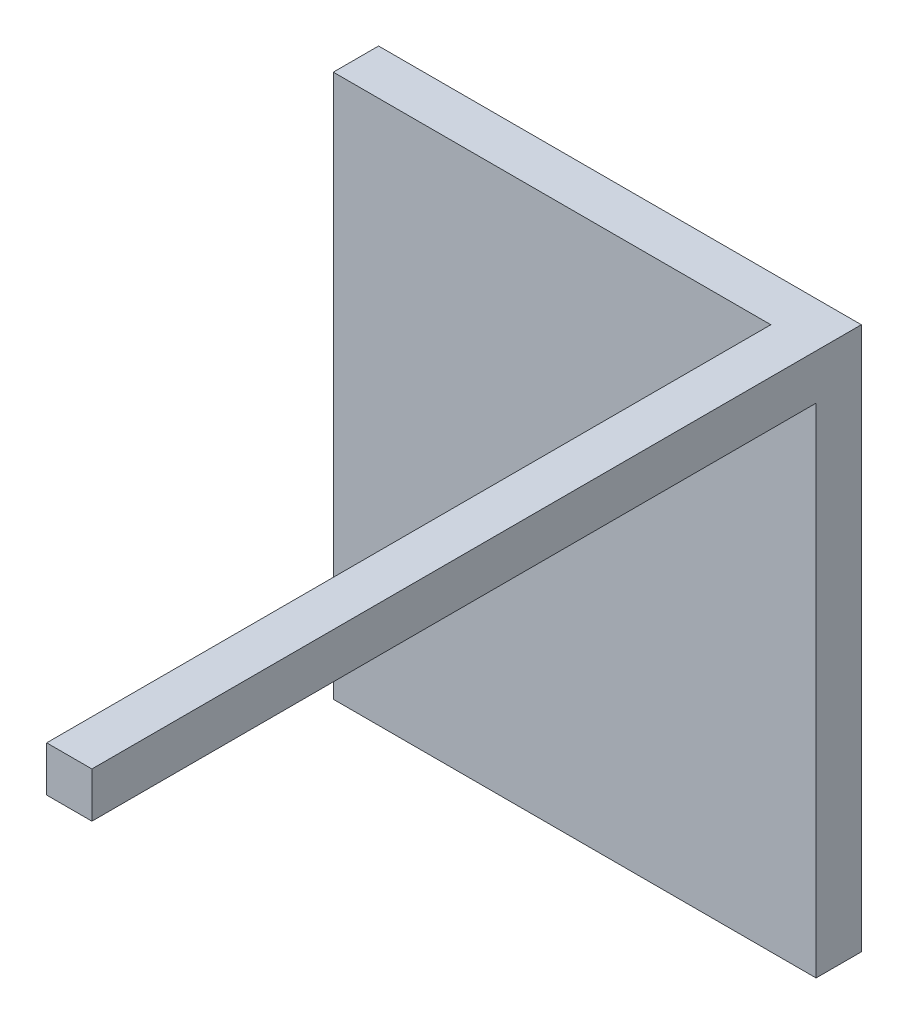
ISO-10303-21;
HEADER;
FILE_DESCRIPTION(('STEP AP214'),'2;1');
FILE_NAME('part.step','',(''),(''),'','','');
FILE_SCHEMA(('AUTOMOTIVE_DESIGN { 1 0 10303 214 1 1 1 1 }'));
ENDSEC;
DATA;
#1=APPLICATION_CONTEXT('core data for automotive mechanical design processes');
#2=APPLICATION_PROTOCOL_DEFINITION('international standard','automotive_design',2000,#1);
#3=PRODUCT_CONTEXT('',#1,'mechanical');
#4=PRODUCT('Part','Part','',(#3));
#5=PRODUCT_RELATED_PRODUCT_CATEGORY('part','',(#4));
#6=PRODUCT_DEFINITION_FORMATION('','',#4);
#7=PRODUCT_DEFINITION_CONTEXT('part definition',#1,'design');
#8=PRODUCT_DEFINITION('design','',#6,#7);
#9=PRODUCT_DEFINITION_SHAPE('','',#8);
#10=(LENGTH_UNIT() NAMED_UNIT(*) SI_UNIT(.MILLI.,.METRE.));
#11=(NAMED_UNIT(*) PLANE_ANGLE_UNIT() SI_UNIT($,.RADIAN.));
#12=(NAMED_UNIT(*) SI_UNIT($,.STERADIAN.) SOLID_ANGLE_UNIT());
#13=UNCERTAINTY_MEASURE_WITH_UNIT(LENGTH_MEASURE(1.E-05),#10,'distance_accuracy_value','');
#14=(GEOMETRIC_REPRESENTATION_CONTEXT(3) GLOBAL_UNCERTAINTY_ASSIGNED_CONTEXT((#13)) GLOBAL_UNIT_ASSIGNED_CONTEXT((#10,
#11,#12)) REPRESENTATION_CONTEXT('',''));
#15=CARTESIAN_POINT('',(0.,0.,0.));
#16=DIRECTION('',(0.,0.,1.));
#17=DIRECTION('',(1.,0.,0.));
#18=AXIS2_PLACEMENT_3D('',#15,#16,#17);
#19=CARTESIAN_POINT('',(0.,228.6,38.1));
#20=DIRECTION('',(-1.,0.,0.));
#21=DIRECTION('',(0.,0.,1.));
#22=AXIS2_PLACEMENT_3D('',#19,#20,#21);
#23=PLANE('',#22);
#24=DIRECTION('',(0.,1.,0.));
#25=VECTOR('',#24,1.);
#26=CARTESIAN_POINT('',(0.,228.6,0.));
#27=LINE('',#26,#25);
#28=CARTESIAN_POINT('',(0.,0.,0.));
#29=VERTEX_POINT('',#28);
#30=CARTESIAN_POINT('',(0.,457.2,0.));
#31=VERTEX_POINT('',#30);
#32=EDGE_CURVE('E118',#29,#31,#27,.T.);
#33=ORIENTED_EDGE('',*,*,#32,.F.);
#34=DIRECTION('',(0.,0.,-1.));
#35=VECTOR('',#34,1.);
#36=CARTESIAN_POINT('',(0.,0.,38.1));
#37=LINE('',#36,#35);
#38=CARTESIAN_POINT('',(0.,0.,38.1));
#39=VERTEX_POINT('',#38);
#40=EDGE_CURVE('E10',#39,#29,#37,.T.);
#41=ORIENTED_EDGE('',*,*,#40,.F.);
#42=DIRECTION('',(0.,1.,0.));
#43=VECTOR('',#42,1.);
#44=CARTESIAN_POINT('',(0.,228.6,38.1));
#45=LINE('',#44,#43);
#46=CARTESIAN_POINT('',(0.,457.2,38.1));
#47=VERTEX_POINT('',#46);
#48=EDGE_CURVE('E131',#39,#47,#45,.T.);
#49=ORIENTED_EDGE('',*,*,#48,.T.);
#50=DIRECTION('',(0.,0.,-1.));
#51=VECTOR('',#50,1.);
#52=CARTESIAN_POINT('',(0.,457.2,38.1));
#53=LINE('',#52,#51);
#54=EDGE_CURVE('E144',#47,#31,#53,.T.);
#55=ORIENTED_EDGE('',*,*,#54,.T.);
#56=EDGE_LOOP('',(#33,#41,#49,#55));
#57=FACE_BOUND('',#56,.T.);
#58=ADVANCED_FACE('F16',(#57),#23,.T.);
#59=CARTESIAN_POINT('',(213.359993903296,0.,38.1));
#60=DIRECTION('',(0.,1.,0.));
#61=DIRECTION('',(0.,0.,1.));
#62=AXIS2_PLACEMENT_3D('',#59,#60,#61);
#63=PLANE('',#62);
#64=DIRECTION('',(1.,0.,0.));
#65=VECTOR('',#64,1.);
#66=CARTESIAN_POINT('',(213.359993903296,0.,0.));
#67=LINE('',#66,#65);
#68=CARTESIAN_POINT('',(406.4,0.,0.));
#69=VERTEX_POINT('',#68);
#70=EDGE_CURVE('E125',#29,#69,#67,.T.);
#71=ORIENTED_EDGE('',*,*,#70,.T.);
#72=DIRECTION('',(0.,0.,-1.));
#73=VECTOR('',#72,1.);
#74=CARTESIAN_POINT('',(406.4,0.,38.1));
#75=LINE('',#74,#73);
#76=CARTESIAN_POINT('',(406.4,0.,38.1));
#77=VERTEX_POINT('',#76);
#78=EDGE_CURVE('E24',#77,#69,#75,.T.);
#79=ORIENTED_EDGE('',*,*,#78,.F.);
#80=DIRECTION('',(1.,0.,0.));
#81=VECTOR('',#80,1.);
#82=CARTESIAN_POINT('',(213.359993903296,0.,38.1));
#83=LINE('',#82,#81);
#84=EDGE_CURVE('E135',#39,#77,#83,.T.);
#85=ORIENTED_EDGE('',*,*,#84,.F.);
#86=ORIENTED_EDGE('',*,*,#40,.T.);
#87=EDGE_LOOP('',(#71,#79,#85,#86));
#88=FACE_BOUND('',#87,.T.);
#89=ADVANCED_FACE('F189',(#88),#63,.F.);
#90=CARTESIAN_POINT('',(406.4,228.6,38.1));
#91=DIRECTION('',(-1.,0.,0.));
#92=DIRECTION('',(0.,-1.,0.));
#93=AXIS2_PLACEMENT_3D('',#90,#91,#92);
#94=PLANE('',#93);
#95=DIRECTION('',(0.,1.,0.));
#96=VECTOR('',#95,1.);
#97=CARTESIAN_POINT('',(406.4,228.6,0.));
#98=LINE('',#97,#96);
#99=CARTESIAN_POINT('',(406.4,457.2,0.));
#100=VERTEX_POINT('',#99);
#101=EDGE_CURVE('E148',#69,#100,#98,.T.);
#102=ORIENTED_EDGE('',*,*,#101,.T.);
#103=DIRECTION('',(0.,0.,-1.));
#104=VECTOR('',#103,1.);
#105=CARTESIAN_POINT('',(406.4,457.2,38.1));
#106=LINE('',#105,#104);
#107=CARTESIAN_POINT('',(406.4,457.2,647.7));
#108=VERTEX_POINT('',#107);
#109=EDGE_CURVE('E157',#108,#100,#106,.T.);
#110=ORIENTED_EDGE('',*,*,#109,.F.);
#111=DIRECTION('',(0.,1.,0.));
#112=VECTOR('',#111,1.);
#113=CARTESIAN_POINT('',(406.4,228.6,647.7));
#114=LINE('',#113,#112);
#115=CARTESIAN_POINT('',(406.4,419.1,647.7));
#116=VERTEX_POINT('',#115);
#117=EDGE_CURVE('E104',#116,#108,#114,.T.);
#118=ORIENTED_EDGE('',*,*,#117,.F.);
#119=DIRECTION('',(0.,0.,-1.));
#120=VECTOR('',#119,1.);
#121=CARTESIAN_POINT('',(406.4,419.1,647.7));
#122=LINE('',#121,#120);
#123=CARTESIAN_POINT('',(406.4,419.1,38.1));
#124=VERTEX_POINT('',#123);
#125=EDGE_CURVE('E99',#116,#124,#122,.T.);
#126=ORIENTED_EDGE('',*,*,#125,.T.);
#127=DIRECTION('',(0.,1.,0.));
#128=VECTOR('',#127,1.);
#129=CARTESIAN_POINT('',(406.4,228.6,38.1));
#130=LINE('',#129,#128);
#131=EDGE_CURVE('E139',#77,#124,#130,.T.);
#132=ORIENTED_EDGE('',*,*,#131,.F.);
#133=ORIENTED_EDGE('',*,*,#78,.T.);
#134=EDGE_LOOP('',(#102,#110,#118,#126,#132,#133));
#135=FACE_BOUND('',#134,.T.);
#136=ADVANCED_FACE('F166',(#135),#94,.F.);
#137=CARTESIAN_POINT('',(243.840006096703,457.2,38.1));
#138=DIRECTION('',(0.,1.,0.));
#139=DIRECTION('',(0.,0.,1.));
#140=AXIS2_PLACEMENT_3D('',#137,#138,#139);
#141=PLANE('',#140);
#142=DIRECTION('',(1.,0.,0.));
#143=VECTOR('',#142,1.);
#144=CARTESIAN_POINT('',(243.840006096703,457.2,0.));
#145=LINE('',#144,#143);
#146=EDGE_CURVE('E136',#31,#100,#145,.T.);
#147=ORIENTED_EDGE('',*,*,#146,.F.);
#148=ORIENTED_EDGE('',*,*,#54,.F.);
#149=DIRECTION('',(1.,0.,0.));
#150=VECTOR('',#149,1.);
#151=CARTESIAN_POINT('',(243.840006096703,457.2,38.1));
#152=LINE('',#151,#150);
#153=CARTESIAN_POINT('',(368.3,457.2,38.1));
#154=VERTEX_POINT('',#153);
#155=EDGE_CURVE('E142',#47,#154,#152,.T.);
#156=ORIENTED_EDGE('',*,*,#155,.T.);
#157=DIRECTION('',(0.,0.,-1.));
#158=VECTOR('',#157,1.);
#159=CARTESIAN_POINT('',(368.3,457.2,647.7));
#160=LINE('',#159,#158);
#161=CARTESIAN_POINT('',(368.3,457.2,647.7));
#162=VERTEX_POINT('',#161);
#163=EDGE_CURVE('E127',#162,#154,#160,.T.);
#164=ORIENTED_EDGE('',*,*,#163,.F.);
#165=DIRECTION('',(1.,0.,0.));
#166=VECTOR('',#165,1.);
#167=CARTESIAN_POINT('',(243.840006096703,457.2,647.7));
#168=LINE('',#167,#166);
#169=EDGE_CURVE('E111',#162,#108,#168,.T.);
#170=ORIENTED_EDGE('',*,*,#169,.T.);
#171=ORIENTED_EDGE('',*,*,#109,.T.);
#172=EDGE_LOOP('',(#147,#148,#156,#164,#170,#171));
#173=FACE_BOUND('',#172,.T.);
#174=ADVANCED_FACE('F175',(#173),#141,.T.);
#175=CARTESIAN_POINT('',(203.2,228.6,38.1));
#176=DIRECTION('',(0.,0.,1.));
#177=DIRECTION('',(1.,0.,0.));
#178=AXIS2_PLACEMENT_3D('',#175,#176,#177);
#179=PLANE('',#178);
#180=DIRECTION('',(0.,-1.,0.));
#181=VECTOR('',#180,1.);
#182=CARTESIAN_POINT('',(368.3,446.850213599205,38.1));
#183=LINE('',#182,#181);
#184=CARTESIAN_POINT('',(368.3,419.1,38.1));
#185=VERTEX_POINT('',#184);
#186=EDGE_CURVE('E43',#154,#185,#183,.T.);
#187=ORIENTED_EDGE('',*,*,#186,.F.);
#188=ORIENTED_EDGE('',*,*,#155,.F.);
#189=ORIENTED_EDGE('',*,*,#48,.F.);
#190=ORIENTED_EDGE('',*,*,#84,.T.);
#191=ORIENTED_EDGE('',*,*,#131,.T.);
#192=DIRECTION('',(1.,0.,0.));
#193=VECTOR('',#192,1.);
#194=CARTESIAN_POINT('',(431.796451067925,419.1,38.1));
#195=LINE('',#194,#193);
#196=EDGE_CURVE('E36',#185,#124,#195,.T.);
#197=ORIENTED_EDGE('',*,*,#196,.F.);
#198=EDGE_LOOP('',(#187,#188,#189,#190,#191,#197));
#199=FACE_BOUND('',#198,.T.);
#200=ADVANCED_FACE('F187',(#199),#179,.T.);
#201=CARTESIAN_POINT('',(203.2,228.6,0.));
#202=DIRECTION('',(0.,0.,1.));
#203=DIRECTION('',(1.,0.,0.));
#204=AXIS2_PLACEMENT_3D('',#201,#202,#203);
#205=PLANE('',#204);
#206=ORIENTED_EDGE('',*,*,#32,.T.);
#207=ORIENTED_EDGE('',*,*,#146,.T.);
#208=ORIENTED_EDGE('',*,*,#101,.F.);
#209=ORIENTED_EDGE('',*,*,#70,.F.);
#210=EDGE_LOOP('',(#206,#207,#208,#209));
#211=FACE_BOUND('',#210,.T.);
#212=ADVANCED_FACE('F171',(#211),#205,.F.);
#213=CARTESIAN_POINT('',(368.3,446.850213599205,647.7));
#214=DIRECTION('',(1.,0.,0.));
#215=DIRECTION('',(0.,1.,0.));
#216=AXIS2_PLACEMENT_3D('',#213,#214,#215);
#217=PLANE('',#216);
#218=ORIENTED_EDGE('',*,*,#186,.T.);
#219=DIRECTION('',(0.,0.,-1.));
#220=VECTOR('',#219,1.);
#221=CARTESIAN_POINT('',(368.3,419.1,647.7));
#222=LINE('',#221,#220);
#223=CARTESIAN_POINT('',(368.3,419.1,647.7));
#224=VERTEX_POINT('',#223);
#225=EDGE_CURVE('E97',#224,#185,#222,.T.);
#226=ORIENTED_EDGE('',*,*,#225,.F.);
#227=DIRECTION('',(0.,-1.,0.));
#228=VECTOR('',#227,1.);
#229=CARTESIAN_POINT('',(368.3,446.850213599205,647.7));
#230=LINE('',#229,#228);
#231=EDGE_CURVE('E105',#162,#224,#230,.T.);
#232=ORIENTED_EDGE('',*,*,#231,.F.);
#233=ORIENTED_EDGE('',*,*,#163,.T.);
#234=EDGE_LOOP('',(#218,#226,#232,#233));
#235=FACE_BOUND('',#234,.T.);
#236=ADVANCED_FACE('F116',(#235),#217,.F.);
#237=CARTESIAN_POINT('',(431.796451067925,419.1,647.7));
#238=DIRECTION('',(0.,1.,0.));
#239=DIRECTION('',(0.,0.,1.));
#240=AXIS2_PLACEMENT_3D('',#237,#238,#239);
#241=PLANE('',#240);
#242=ORIENTED_EDGE('',*,*,#196,.T.);
#243=ORIENTED_EDGE('',*,*,#125,.F.);
#244=DIRECTION('',(1.,0.,0.));
#245=VECTOR('',#244,1.);
#246=CARTESIAN_POINT('',(431.796451067925,419.1,647.7));
#247=LINE('',#246,#245);
#248=EDGE_CURVE('E93',#224,#116,#247,.T.);
#249=ORIENTED_EDGE('',*,*,#248,.F.);
#250=ORIENTED_EDGE('',*,*,#225,.T.);
#251=EDGE_LOOP('',(#242,#243,#249,#250));
#252=FACE_BOUND('',#251,.T.);
#253=ADVANCED_FACE('F95',(#252),#241,.F.);
#254=CARTESIAN_POINT('',(203.2,228.6,647.7));
#255=DIRECTION('',(0.,0.,1.));
#256=DIRECTION('',(1.,0.,0.));
#257=AXIS2_PLACEMENT_3D('',#254,#255,#256);
#258=PLANE('',#257);
#259=ORIENTED_EDGE('',*,*,#231,.T.);
#260=ORIENTED_EDGE('',*,*,#248,.T.);
#261=ORIENTED_EDGE('',*,*,#117,.T.);
#262=ORIENTED_EDGE('',*,*,#169,.F.);
#263=EDGE_LOOP('',(#259,#260,#261,#262));
#264=FACE_BOUND('',#263,.T.);
#265=ADVANCED_FACE('F109',(#264),#258,.T.);
#266=CLOSED_SHELL('',(#58,#89,#136,#174,#200,#212,#236,#253,#265));
#267=MANIFOLD_SOLID_BREP('B1',#266);
#268=ADVANCED_BREP_SHAPE_REPRESENTATION('',(#18,#267),#14);
#269=SHAPE_DEFINITION_REPRESENTATION(#9,#268);
ENDSEC;
END-ISO-10303-21;
